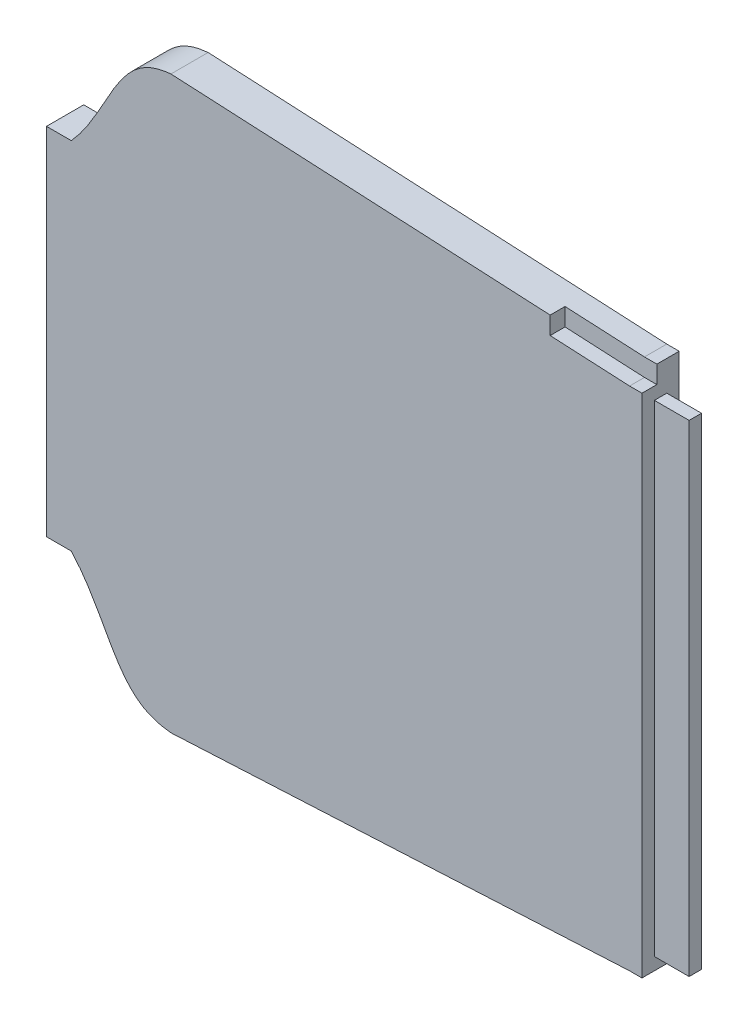
ISO-10303-21;
HEADER;
FILE_DESCRIPTION(('STEP AP214'),'2;1');
FILE_NAME('part.step','',(''),(''),'','','');
FILE_SCHEMA(('AUTOMOTIVE_DESIGN { 1 0 10303 214 1 1 1 1 }'));
ENDSEC;
DATA;
#1=APPLICATION_CONTEXT('core data for automotive mechanical design processes');
#2=APPLICATION_PROTOCOL_DEFINITION('international standard','automotive_design',2000,#1);
#3=PRODUCT_CONTEXT('',#1,'mechanical');
#4=PRODUCT('Part','Part','',(#3));
#5=PRODUCT_RELATED_PRODUCT_CATEGORY('part','',(#4));
#6=PRODUCT_DEFINITION_FORMATION('','',#4);
#7=PRODUCT_DEFINITION_CONTEXT('part definition',#1,'design');
#8=PRODUCT_DEFINITION('design','',#6,#7);
#9=PRODUCT_DEFINITION_SHAPE('','',#8);
#10=(LENGTH_UNIT() NAMED_UNIT(*) SI_UNIT(.MILLI.,.METRE.));
#11=(NAMED_UNIT(*) PLANE_ANGLE_UNIT() SI_UNIT($,.RADIAN.));
#12=(NAMED_UNIT(*) SI_UNIT($,.STERADIAN.) SOLID_ANGLE_UNIT());
#13=UNCERTAINTY_MEASURE_WITH_UNIT(LENGTH_MEASURE(1.E-05),#10,'distance_accuracy_value','');
#14=(GEOMETRIC_REPRESENTATION_CONTEXT(3) GLOBAL_UNCERTAINTY_ASSIGNED_CONTEXT((#13)) GLOBAL_UNIT_ASSIGNED_CONTEXT((#10,
#11,#12)) REPRESENTATION_CONTEXT('',''));
#15=CARTESIAN_POINT('',(0.,0.,0.));
#16=DIRECTION('',(0.,0.,1.));
#17=DIRECTION('',(1.,0.,0.));
#18=AXIS2_PLACEMENT_3D('',#15,#16,#17);
#19=CARTESIAN_POINT('',(-75.9633453556021,51.4759528273383,7.5));
#20=CARTESIAN_POINT('',(-76.9697609445029,51.3853111688269,7.5));
#21=CARTESIAN_POINT('',(-77.9566640125475,51.2137423355585,7.5));
#22=CARTESIAN_POINT('',(-79.3958667890357,50.7857140096499,7.5));
#23=CARTESIAN_POINT('',(-79.8697086301998,50.6138711938557,7.5));
#24=CARTESIAN_POINT('',(-80.7968371847401,50.2045771988286,7.5));
#25=CARTESIAN_POINT('',(-81.2405903652447,49.971323111468,7.5));
#26=CARTESIAN_POINT('',(-82.0897874142373,49.4494965490873,7.5));
#27=CARTESIAN_POINT('',(-82.4952469763131,49.160946735502,7.5));
#28=CARTESIAN_POINT('',(-83.2714650489406,48.5337390244384,7.5));
#29=CARTESIAN_POINT('',(-83.6430074345988,48.1943757140935,7.5));
#30=CARTESIAN_POINT('',(-84.7084440423344,47.1167950418134,7.5));
#31=CARTESIAN_POINT('',(-85.3332150008267,46.3433741392448,7.5));
#32=CARTESIAN_POINT('',(-86.4912968836569,44.7376760965746,7.5));
#33=CARTESIAN_POINT('',(-87.0238276066962,43.9048968823881,7.5));
#34=CARTESIAN_POINT('',(-88.0448723627031,42.2110128931271,7.5));
#35=CARTESIAN_POINT('',(-88.5330340538759,41.349681379537,7.5));
#36=CARTESIAN_POINT('',(-89.9829007271193,38.7562796255846,7.5));
#37=CARTESIAN_POINT('',(-90.9324072603648,37.0136286536666,7.5));
#38=CARTESIAN_POINT('',(-92.999467157365,33.6503839465377,7.5));
#39=CARTESIAN_POINT('',(-94.1145861067505,32.0312326414741,7.5));
#40=CARTESIAN_POINT('',(-95.6033721198785,30.2877052809041,7.5));
#41=CARTESIAN_POINT('',(-95.8197445647223,30.0428919157174,7.5));
#42=CARTESIAN_POINT('',(-96.0408999342454,29.8017407392617,7.5));
#43=B_SPLINE_CURVE_WITH_KNOTS('',3,(#19,#20,#21,#22,#23,#24,#25,#26,#27,#28,#29,#30,#31,#32,#33,
#34,#35,#36,#37,#38,#39,#40,#41,#42),.UNSPECIFIED.,.F.,.F.,(4,2,2,2,2,2,2,2,2,2,2,4),(0.,
0.0624999999999994,0.0937499999999991,0.124999999999999,0.156249999999999,0.187499999999998,
0.249999999999998,0.312499999999998,0.374999999999998,0.499999999999997,0.624999999999997,
0.645748557674842),.UNSPECIFIED.);
#44=DIRECTION('',(0.,0.,-1.));
#45=VECTOR('',#44,1.);
#46=SURFACE_OF_LINEAR_EXTRUSION('',#43,#45);
#47=CARTESIAN_POINT('',(-75.9633453556021,51.4759528273383,0.));
#48=CARTESIAN_POINT('',(-76.9697609445029,51.3853111688269,0.));
#49=CARTESIAN_POINT('',(-77.9566640125475,51.2137423355585,0.));
#50=CARTESIAN_POINT('',(-79.3958667890357,50.7857140096499,0.));
#51=CARTESIAN_POINT('',(-79.8697086301998,50.6138711938557,0.));
#52=CARTESIAN_POINT('',(-80.7968371847401,50.2045771988286,0.));
#53=CARTESIAN_POINT('',(-81.2405903652447,49.971323111468,0.));
#54=CARTESIAN_POINT('',(-82.0897874142373,49.4494965490873,0.));
#55=CARTESIAN_POINT('',(-82.4952469763131,49.160946735502,0.));
#56=CARTESIAN_POINT('',(-83.2714650489406,48.5337390244384,0.));
#57=CARTESIAN_POINT('',(-83.6430074345988,48.1943757140935,0.));
#58=CARTESIAN_POINT('',(-84.7084440423344,47.1167950418134,0.));
#59=CARTESIAN_POINT('',(-85.3332150008267,46.3433741392448,0.));
#60=CARTESIAN_POINT('',(-86.4912968836569,44.7376760965746,0.));
#61=CARTESIAN_POINT('',(-87.0238276066962,43.9048968823881,0.));
#62=CARTESIAN_POINT('',(-88.0448723627031,42.2110128931271,0.));
#63=CARTESIAN_POINT('',(-88.5330340538759,41.349681379537,0.));
#64=CARTESIAN_POINT('',(-89.9829007271193,38.7562796255846,0.));
#65=CARTESIAN_POINT('',(-90.9324072603648,37.0136286536666,0.));
#66=CARTESIAN_POINT('',(-92.999467157365,33.6503839465377,0.));
#67=CARTESIAN_POINT('',(-94.1145861067505,32.0312326414741,0.));
#68=CARTESIAN_POINT('',(-95.6033721198785,30.2877052809041,0.));
#69=CARTESIAN_POINT('',(-95.8197445647223,30.0428919157174,0.));
#70=CARTESIAN_POINT('',(-96.0408999342454,29.8017407392617,0.));
#71=B_SPLINE_CURVE_WITH_KNOTS('',3,(#47,#48,#49,#50,#51,#52,#53,#54,#55,#56,#57,#58,#59,#60,#61,
#62,#63,#64,#65,#66,#67,#68,#69,#70),.UNSPECIFIED.,.F.,.F.,(4,2,2,2,2,2,2,2,2,2,2,4),(0.,
0.0624999999999994,0.0937499999999991,0.124999999999999,0.156249999999999,0.187499999999998,
0.249999999999998,0.312499999999998,0.374999999999998,0.499999999999997,0.624999999999997,
0.645748557674842),.UNSPECIFIED.);
#72=CARTESIAN_POINT('',(-75.9633453556021,51.4759528273383,0.));
#73=VERTEX_POINT('',#72);
#74=CARTESIAN_POINT('',(-96.0408999342454,29.8017407392617,0.));
#75=VERTEX_POINT('',#74);
#76=EDGE_CURVE('E231',#73,#75,#71,.T.);
#77=ORIENTED_EDGE('',*,*,#76,.T.);
#78=DIRECTION('',(0.,0.,-1.));
#79=VECTOR('',#78,1.);
#80=CARTESIAN_POINT('',(-96.0408999342454,29.8017407392617,7.5));
#81=LINE('',#80,#79);
#82=CARTESIAN_POINT('',(-96.0408999342454,29.8017407392617,7.5));
#83=VERTEX_POINT('',#82);
#84=EDGE_CURVE('E391',#83,#75,#81,.T.);
#85=ORIENTED_EDGE('',*,*,#84,.F.);
#86=CARTESIAN_POINT('',(-96.0408999342454,29.8017407392617,7.5));
#87=CARTESIAN_POINT('',(-95.8197445647223,30.0428919157174,7.5));
#88=CARTESIAN_POINT('',(-95.6033721198785,30.2877052809041,7.5));
#89=CARTESIAN_POINT('',(-94.1145861067505,32.0312326414741,7.5));
#90=CARTESIAN_POINT('',(-92.999467157365,33.6503839465377,7.5));
#91=CARTESIAN_POINT('',(-90.9324072603648,37.0136286536666,7.5));
#92=CARTESIAN_POINT('',(-89.9829007271193,38.7562796255846,7.5));
#93=CARTESIAN_POINT('',(-88.5330340538759,41.349681379537,7.5));
#94=CARTESIAN_POINT('',(-88.0448723627031,42.2110128931271,7.5));
#95=CARTESIAN_POINT('',(-87.0238276066962,43.9048968823881,7.5));
#96=CARTESIAN_POINT('',(-86.4912968836569,44.7376760965746,7.5));
#97=CARTESIAN_POINT('',(-85.3332150008267,46.3433741392448,7.5));
#98=CARTESIAN_POINT('',(-84.7084440423344,47.1167950418134,7.5));
#99=CARTESIAN_POINT('',(-83.6430074345988,48.1943757140935,7.5));
#100=CARTESIAN_POINT('',(-83.2714650489406,48.5337390244384,7.5));
#101=CARTESIAN_POINT('',(-82.4952469763131,49.160946735502,7.5));
#102=CARTESIAN_POINT('',(-82.0897874142373,49.4494965490873,7.5));
#103=CARTESIAN_POINT('',(-81.2405903652447,49.971323111468,7.5));
#104=CARTESIAN_POINT('',(-80.7968371847401,50.2045771988286,7.5));
#105=CARTESIAN_POINT('',(-79.8697086301998,50.6138711938557,7.5));
#106=CARTESIAN_POINT('',(-79.3958667890357,50.7857140096499,7.5));
#107=CARTESIAN_POINT('',(-77.9566640125475,51.2137423355585,7.5));
#108=CARTESIAN_POINT('',(-76.9697609445029,51.3853111688269,7.5));
#109=CARTESIAN_POINT('',(-75.9633453556021,51.4759528273383,7.5));
#110=B_SPLINE_CURVE_WITH_KNOTS('',3,(#86,#87,#88,#89,#90,#91,#92,#93,#94,#95,#96,#97,#98,#99,
#100,#101,#102,#103,#104,#105,#106,#107,#108,#109),.UNSPECIFIED.,.F.,.F.,(4,2,2,2,2,2,2,2,2,2,2,
4),(0.,0.0207485576748445,0.145748557674845,0.270748557674844,0.333248557674844,
0.395748557674844,0.458248557674844,0.489498557674843,0.520748557674843,0.551998557674843,
0.583248557674843,0.645748557674842),.UNSPECIFIED.);
#111=CARTESIAN_POINT('',(-75.9633453556021,51.4759528273383,7.5));
#112=VERTEX_POINT('',#111);
#113=EDGE_CURVE('E388',#112,#83,#110,.F.);
#114=ORIENTED_EDGE('',*,*,#113,.F.);
#115=DIRECTION('',(0.,0.,-1.));
#116=VECTOR('',#115,1.);
#117=CARTESIAN_POINT('',(-75.9633453556021,51.4759528273383,7.5));
#118=LINE('',#117,#116);
#119=EDGE_CURVE('E327',#112,#73,#118,.T.);
#120=ORIENTED_EDGE('',*,*,#119,.T.);
#121=EDGE_LOOP('',(#77,#85,#114,#120));
#122=FACE_BOUND('',#121,.T.);
#123=ADVANCED_FACE('F36',(#122),#46,.F.);
#124=CARTESIAN_POINT('',(-101.040899934245,29.8017407392617,7.5));
#125=DIRECTION('',(0.,-1.,0.));
#126=DIRECTION('',(0.,0.,-1.));
#127=AXIS2_PLACEMENT_3D('',#124,#125,#126);
#128=PLANE('',#127);
#129=DIRECTION('',(-1.,0.,0.));
#130=VECTOR('',#129,1.);
#131=CARTESIAN_POINT('',(-101.040899934245,29.8017407392617,0.));
#132=LINE('',#131,#130);
#133=CARTESIAN_POINT('',(-101.040899934245,29.8017407392617,0.));
#134=VERTEX_POINT('',#133);
#135=EDGE_CURVE('E315',#75,#134,#132,.T.);
#136=ORIENTED_EDGE('',*,*,#135,.T.);
#137=DIRECTION('',(0.,0.,-1.));
#138=VECTOR('',#137,1.);
#139=CARTESIAN_POINT('',(-101.040899934245,29.8017407392617,7.5));
#140=LINE('',#139,#138);
#141=CARTESIAN_POINT('',(-101.040899934245,29.8017407392617,7.5));
#142=VERTEX_POINT('',#141);
#143=EDGE_CURVE('E334',#142,#134,#140,.T.);
#144=ORIENTED_EDGE('',*,*,#143,.F.);
#145=DIRECTION('',(-1.,0.,0.));
#146=VECTOR('',#145,1.);
#147=CARTESIAN_POINT('',(-101.040899934245,29.8017407392617,7.5));
#148=LINE('',#147,#146);
#149=EDGE_CURVE('E243',#83,#142,#148,.T.);
#150=ORIENTED_EDGE('',*,*,#149,.F.);
#151=ORIENTED_EDGE('',*,*,#84,.T.);
#152=EDGE_LOOP('',(#136,#144,#150,#151));
#153=FACE_BOUND('',#152,.T.);
#154=ADVANCED_FACE('F411',(#153),#128,.F.);
#155=CARTESIAN_POINT('',(-101.040899934245,-41.8292599626899,7.5));
#156=DIRECTION('',(1.,0.,0.));
#157=DIRECTION('',(0.,0.,-1.));
#158=AXIS2_PLACEMENT_3D('',#155,#156,#157);
#159=PLANE('',#158);
#160=DIRECTION('',(0.,-1.,0.));
#161=VECTOR('',#160,1.);
#162=CARTESIAN_POINT('',(-101.040899934245,-41.8292599626899,0.));
#163=LINE('',#162,#161);
#164=CARTESIAN_POINT('',(-101.040899934245,-41.8292599626899,0.));
#165=VERTEX_POINT('',#164);
#166=EDGE_CURVE('E248',#134,#165,#163,.T.);
#167=ORIENTED_EDGE('',*,*,#166,.T.);
#168=DIRECTION('',(0.,0.,-1.));
#169=VECTOR('',#168,1.);
#170=CARTESIAN_POINT('',(-101.040899934245,-41.8292599626899,7.5));
#171=LINE('',#170,#169);
#172=CARTESIAN_POINT('',(-101.040899934245,-41.8292599626899,7.5));
#173=VERTEX_POINT('',#172);
#174=EDGE_CURVE('E369',#173,#165,#171,.T.);
#175=ORIENTED_EDGE('',*,*,#174,.F.);
#176=DIRECTION('',(0.,-1.,0.));
#177=VECTOR('',#176,1.);
#178=CARTESIAN_POINT('',(-101.040899934245,-41.8292599626899,7.5));
#179=LINE('',#178,#177);
#180=EDGE_CURVE('E237',#142,#173,#179,.T.);
#181=ORIENTED_EDGE('',*,*,#180,.F.);
#182=ORIENTED_EDGE('',*,*,#143,.T.);
#183=EDGE_LOOP('',(#167,#175,#181,#182));
#184=FACE_BOUND('',#183,.T.);
#185=ADVANCED_FACE('F615',(#184),#159,.F.);
#186=CARTESIAN_POINT('',(-96.0408999342454,-41.8292599626899,7.5));
#187=DIRECTION('',(0.,1.,0.));
#188=DIRECTION('',(0.,0.,1.));
#189=AXIS2_PLACEMENT_3D('',#186,#187,#188);
#190=PLANE('',#189);
#191=DIRECTION('',(1.,0.,0.));
#192=VECTOR('',#191,1.);
#193=CARTESIAN_POINT('',(-96.0408999342454,-41.8292599626899,0.));
#194=LINE('',#193,#192);
#195=CARTESIAN_POINT('',(-96.0408999342454,-41.8292599626899,0.));
#196=VERTEX_POINT('',#195);
#197=EDGE_CURVE('E291',#165,#196,#194,.T.);
#198=ORIENTED_EDGE('',*,*,#197,.T.);
#199=DIRECTION('',(0.,0.,-1.));
#200=VECTOR('',#199,1.);
#201=CARTESIAN_POINT('',(-96.0408999342454,-41.8292599626899,7.5));
#202=LINE('',#201,#200);
#203=CARTESIAN_POINT('',(-96.0408999342454,-41.8292599626899,7.5));
#204=VERTEX_POINT('',#203);
#205=EDGE_CURVE('E360',#204,#196,#202,.T.);
#206=ORIENTED_EDGE('',*,*,#205,.F.);
#207=DIRECTION('',(1.,0.,0.));
#208=VECTOR('',#207,1.);
#209=CARTESIAN_POINT('',(-96.0408999342454,-41.8292599626899,7.5));
#210=LINE('',#209,#208);
#211=EDGE_CURVE('E242',#173,#204,#210,.T.);
#212=ORIENTED_EDGE('',*,*,#211,.F.);
#213=ORIENTED_EDGE('',*,*,#174,.T.);
#214=EDGE_LOOP('',(#198,#206,#212,#213));
#215=FACE_BOUND('',#214,.T.);
#216=ADVANCED_FACE('F260',(#215),#190,.F.);
#217=CARTESIAN_POINT('',(-96.0408999342454,-41.8292599626899,7.5));
#218=CARTESIAN_POINT('',(-95.7988992682846,-42.0931600962344,7.5));
#219=CARTESIAN_POINT('',(-95.561972130062,-42.3621361828799,7.5));
#220=CARTESIAN_POINT('',(-94.0395496597358,-44.1567580273599,7.5));
#221=CARTESIAN_POINT('',(-92.923608678234,-45.7924124369332,7.5));
#222=CARTESIAN_POINT('',(-90.8584877162527,-49.1709486953091,7.5));
#223=CARTESIAN_POINT('',(-89.9110655120972,-50.9149607955065,7.5));
#224=CARTESIAN_POINT('',(-88.4577666320856,-53.510296459571,7.5));
#225=CARTESIAN_POINT('',(-87.9675202616666,-54.3719999042443,7.5));
#226=CARTESIAN_POINT('',(-86.9408927812385,-56.0639292800719,7.5));
#227=CARTESIAN_POINT('',(-86.4049123225657,-56.8942548138955,7.5));
#228=CARTESIAN_POINT('',(-85.5306714386245,-58.0912594126719,7.5));
#229=CARTESIAN_POINT('',(-85.2274148024828,-58.4820897306125,7.5));
#230=CARTESIAN_POINT('',(-84.5888180979117,-59.2416140461347,7.5));
#231=CARTESIAN_POINT('',(-84.2541847043079,-59.609132258988,7.5));
#232=CARTESIAN_POINT('',(-83.2049299164517,-60.6516003972093,7.5));
#233=CARTESIAN_POINT('',(-82.4405695411778,-61.2705768908685,7.5));
#234=CARTESIAN_POINT('',(-81.160629248783,-62.0427184442392,7.5));
#235=CARTESIAN_POINT('',(-80.7192557418982,-62.2694331130613,7.5));
#236=CARTESIAN_POINT('',(-79.8173141056628,-62.6608889281113,7.5));
#237=CARTESIAN_POINT('',(-79.3554021000776,-62.8265490472613,7.5));
#238=CARTESIAN_POINT('',(-77.9404670922337,-63.2432868270751,7.5));
#239=CARTESIAN_POINT('',(-76.9542083277771,-63.4142013981837,7.5));
#240=CARTESIAN_POINT('',(-75.9633453556009,-63.5034423282191,7.5));
#241=B_SPLINE_CURVE_WITH_KNOTS('',3,(#217,#218,#219,#220,#221,#222,#223,#224,#225,#226,#227,
#228,#229,#230,#231,#232,#233,#234,#235,#236,#237,#238,#239,#240),.UNSPECIFIED.,.F.,.F.,(4,2,2,
2,2,2,2,2,2,2,2,4),(0.352672192174141,0.375000000000001,0.500000000000001,0.625000000000001,
0.687500000000001,0.750000000000001,0.781250000000001,0.812500000000001,0.875000000000001,
0.90625,0.9375,1.),.UNSPECIFIED.);
#242=DIRECTION('',(0.,0.,-1.));
#243=VECTOR('',#242,1.);
#244=SURFACE_OF_LINEAR_EXTRUSION('',#241,#243);
#245=CARTESIAN_POINT('',(-96.0408999342454,-41.8292599626899,0.));
#246=CARTESIAN_POINT('',(-95.7988992682846,-42.0931600962344,0.));
#247=CARTESIAN_POINT('',(-95.561972130062,-42.3621361828799,0.));
#248=CARTESIAN_POINT('',(-94.0395496597358,-44.1567580273599,0.));
#249=CARTESIAN_POINT('',(-92.923608678234,-45.7924124369332,0.));
#250=CARTESIAN_POINT('',(-90.8584877162527,-49.1709486953091,0.));
#251=CARTESIAN_POINT('',(-89.9110655120972,-50.9149607955065,0.));
#252=CARTESIAN_POINT('',(-88.4577666320856,-53.510296459571,0.));
#253=CARTESIAN_POINT('',(-87.9675202616666,-54.3719999042443,0.));
#254=CARTESIAN_POINT('',(-86.9408927812385,-56.0639292800719,0.));
#255=CARTESIAN_POINT('',(-86.4049123225657,-56.8942548138955,0.));
#256=CARTESIAN_POINT('',(-85.5306714386245,-58.0912594126719,0.));
#257=CARTESIAN_POINT('',(-85.2274148024828,-58.4820897306125,0.));
#258=CARTESIAN_POINT('',(-84.5888180979117,-59.2416140461347,0.));
#259=CARTESIAN_POINT('',(-84.2541847043079,-59.609132258988,0.));
#260=CARTESIAN_POINT('',(-83.2049299164517,-60.6516003972093,0.));
#261=CARTESIAN_POINT('',(-82.4405695411778,-61.2705768908685,0.));
#262=CARTESIAN_POINT('',(-81.160629248783,-62.0427184442392,0.));
#263=CARTESIAN_POINT('',(-80.7192557418982,-62.2694331130613,0.));
#264=CARTESIAN_POINT('',(-79.8173141056628,-62.6608889281113,0.));
#265=CARTESIAN_POINT('',(-79.3554021000776,-62.8265490472613,0.));
#266=CARTESIAN_POINT('',(-77.9404670922337,-63.2432868270751,0.));
#267=CARTESIAN_POINT('',(-76.9542083277771,-63.4142013981837,0.));
#268=CARTESIAN_POINT('',(-75.9633453556009,-63.5034423282191,0.));
#269=B_SPLINE_CURVE_WITH_KNOTS('',3,(#245,#246,#247,#248,#249,#250,#251,#252,#253,#254,#255,
#256,#257,#258,#259,#260,#261,#262,#263,#264,#265,#266,#267,#268),.UNSPECIFIED.,.F.,.F.,(4,2,2,
2,2,2,2,2,2,2,2,4),(0.352672192174141,0.375000000000001,0.500000000000001,0.625000000000001,
0.687500000000001,0.750000000000001,0.781250000000001,0.812500000000001,0.875000000000001,
0.90625,0.9375,1.),.UNSPECIFIED.);
#270=CARTESIAN_POINT('',(-75.9633453556009,-63.5034423282191,0.));
#271=VERTEX_POINT('',#270);
#272=EDGE_CURVE('E286',#196,#271,#269,.T.);
#273=ORIENTED_EDGE('',*,*,#272,.T.);
#274=DIRECTION('',(0.,0.,-1.));
#275=VECTOR('',#274,1.);
#276=CARTESIAN_POINT('',(-75.9633453556009,-63.5034423282191,7.5));
#277=LINE('',#276,#275);
#278=CARTESIAN_POINT('',(-75.9633453556009,-63.5034423282191,7.5));
#279=VERTEX_POINT('',#278);
#280=EDGE_CURVE('E362',#279,#271,#277,.T.);
#281=ORIENTED_EDGE('',*,*,#280,.F.);
#282=CARTESIAN_POINT('',(-75.9633453556009,-63.5034423282191,7.5));
#283=CARTESIAN_POINT('',(-76.9542083277771,-63.4142013981837,7.5));
#284=CARTESIAN_POINT('',(-77.9404670922337,-63.2432868270751,7.5));
#285=CARTESIAN_POINT('',(-79.3554021000776,-62.8265490472613,7.5));
#286=CARTESIAN_POINT('',(-79.8173141056628,-62.6608889281113,7.5));
#287=CARTESIAN_POINT('',(-80.7192557418982,-62.2694331130613,7.5));
#288=CARTESIAN_POINT('',(-81.160629248783,-62.0427184442392,7.5));
#289=CARTESIAN_POINT('',(-82.4405695411778,-61.2705768908685,7.5));
#290=CARTESIAN_POINT('',(-83.2049299164517,-60.6516003972093,7.5));
#291=CARTESIAN_POINT('',(-84.2541847043079,-59.609132258988,7.5));
#292=CARTESIAN_POINT('',(-84.5888180979117,-59.2416140461347,7.5));
#293=CARTESIAN_POINT('',(-85.2274148024828,-58.4820897306125,7.5));
#294=CARTESIAN_POINT('',(-85.5306714386245,-58.0912594126719,7.5));
#295=CARTESIAN_POINT('',(-86.4049123225657,-56.8942548138955,7.5));
#296=CARTESIAN_POINT('',(-86.9408927812385,-56.0639292800719,7.5));
#297=CARTESIAN_POINT('',(-87.9675202616666,-54.3719999042443,7.5));
#298=CARTESIAN_POINT('',(-88.4577666320856,-53.510296459571,7.5));
#299=CARTESIAN_POINT('',(-89.9110655120972,-50.9149607955065,7.5));
#300=CARTESIAN_POINT('',(-90.8584877162527,-49.1709486953091,7.5));
#301=CARTESIAN_POINT('',(-92.923608678234,-45.7924124369332,7.5));
#302=CARTESIAN_POINT('',(-94.0395496597358,-44.1567580273599,7.5));
#303=CARTESIAN_POINT('',(-95.561972130062,-42.3621361828799,7.5));
#304=CARTESIAN_POINT('',(-95.7988992682846,-42.0931600962344,7.5));
#305=CARTESIAN_POINT('',(-96.0408999342454,-41.8292599626899,7.5));
#306=B_SPLINE_CURVE_WITH_KNOTS('',3,(#282,#283,#284,#285,#286,#287,#288,#289,#290,#291,#292,
#293,#294,#295,#296,#297,#298,#299,#300,#301,#302,#303,#304,#305),.UNSPECIFIED.,.F.,.F.,(4,2,2,
2,2,2,2,2,2,2,2,4),(0.352672192174141,0.415172192174141,0.446422192174141,0.477672192174141,
0.54017219217414,0.57142219217414,0.60267219217414,0.66517219217414,0.72767219217414,
0.85267219217414,0.97767219217414,1.),.UNSPECIFIED.);
#307=EDGE_CURVE('E339',#204,#279,#306,.F.);
#308=ORIENTED_EDGE('',*,*,#307,.F.);
#309=ORIENTED_EDGE('',*,*,#205,.T.);
#310=EDGE_LOOP('',(#273,#281,#308,#309));
#311=FACE_BOUND('',#310,.T.);
#312=ADVANCED_FACE('F254',(#311),#244,.F.);
#313=CARTESIAN_POINT('',(-75.9633453556009,-63.5034423282191,7.5));
#314=DIRECTION('',(-0.0504790708541748,0.998725119042121,0.));
#315=DIRECTION('',(-0.998725119042121,-0.0504790708541748,0.));
#316=AXIS2_PLACEMENT_3D('',#313,#314,#315);
#317=PLANE('',#316);
#318=DIRECTION('',(0.998725119042121,0.0504790708541748,0.));
#319=VECTOR('',#318,1.);
#320=CARTESIAN_POINT('',(-75.9633453556009,-63.5034423282191,0.));
#321=LINE('',#320,#319);
#322=CARTESIAN_POINT('',(16.4591000657546,-58.8320877362616,0.));
#323=VERTEX_POINT('',#322);
#324=EDGE_CURVE('E342',#271,#323,#321,.T.);
#325=ORIENTED_EDGE('',*,*,#324,.T.);
#326=DIRECTION('',(0.,0.,1.));
#327=VECTOR('',#326,1.);
#328=CARTESIAN_POINT('',(16.4591000657546,-58.8320877362616,7.5));
#329=LINE('',#328,#327);
#330=CARTESIAN_POINT('',(16.4591000657546,-58.8320877362616,7.5));
#331=VERTEX_POINT('',#330);
#332=EDGE_CURVE('E11',#323,#331,#329,.T.);
#333=ORIENTED_EDGE('',*,*,#332,.T.);
#334=DIRECTION('',(0.998725119042121,0.0504790708541748,0.));
#335=VECTOR('',#334,1.);
#336=CARTESIAN_POINT('',(-75.9633453556009,-63.5034423282191,7.5));
#337=LINE('',#336,#335);
#338=EDGE_CURVE('E328',#279,#331,#337,.T.);
#339=ORIENTED_EDGE('',*,*,#338,.F.);
#340=ORIENTED_EDGE('',*,*,#280,.T.);
#341=EDGE_LOOP('',(#325,#333,#339,#340));
#342=FACE_BOUND('',#341,.T.);
#343=ADVANCED_FACE('F259',(#342),#317,.F.);
#344=CARTESIAN_POINT('',(113.496599029254,41.8999826486839,7.5));
#345=DIRECTION('',(-0.0504790708541185,-0.998725119042124,0.));
#346=DIRECTION('',(0.998725119042124,-0.0504790708541185,0.));
#347=AXIS2_PLACEMENT_3D('',#344,#345,#346);
#348=PLANE('',#347);
#349=DIRECTION('',(0.998725119042124,-0.0504790708541185,0.));
#350=VECTOR('',#349,1.);
#351=CARTESIAN_POINT('',(0.459100065754559,47.6132943603423,4.5));
#352=LINE('',#351,#350);
#353=CARTESIAN_POINT('',(0.459100065754559,47.6132943603423,4.5));
#354=VERTEX_POINT('',#353);
#355=CARTESIAN_POINT('',(16.4591000657546,46.804598235386,4.5));
#356=VERTEX_POINT('',#355);
#357=EDGE_CURVE('E222',#354,#356,#352,.T.);
#358=ORIENTED_EDGE('',*,*,#357,.T.);
#359=DIRECTION('',(0.,0.,-1.));
#360=VECTOR('',#359,1.);
#361=CARTESIAN_POINT('',(16.4591000657546,46.804598235386,7.5));
#362=LINE('',#361,#360);
#363=CARTESIAN_POINT('',(16.4591000657546,46.804598235386,0.));
#364=VERTEX_POINT('',#363);
#365=EDGE_CURVE('E45',#356,#364,#362,.T.);
#366=ORIENTED_EDGE('',*,*,#365,.T.);
#367=DIRECTION('',(-0.998725119042124,0.0504790708541185,0.));
#368=VECTOR('',#367,1.);
#369=CARTESIAN_POINT('',(113.496599029254,41.8999826486839,0.));
#370=LINE('',#369,#368);
#371=EDGE_CURVE('E329',#364,#73,#370,.T.);
#372=ORIENTED_EDGE('',*,*,#371,.T.);
#373=ORIENTED_EDGE('',*,*,#119,.F.);
#374=DIRECTION('',(-0.998725119042124,0.0504790708541185,0.));
#375=VECTOR('',#374,1.);
#376=CARTESIAN_POINT('',(113.496599029254,41.8999826486839,7.5));
#377=LINE('',#376,#375);
#378=CARTESIAN_POINT('',(0.459100065754559,47.6132943603423,7.5));
#379=VERTEX_POINT('',#378);
#380=EDGE_CURVE('E324',#379,#112,#377,.T.);
#381=ORIENTED_EDGE('',*,*,#380,.F.);
#382=DIRECTION('',(0.,0.,1.));
#383=VECTOR('',#382,1.);
#384=CARTESIAN_POINT('',(0.459100065754559,47.6132943603423,4.5));
#385=LINE('',#384,#383);
#386=EDGE_CURVE('E229',#354,#379,#385,.T.);
#387=ORIENTED_EDGE('',*,*,#386,.F.);
#388=EDGE_LOOP('',(#358,#366,#372,#373,#381,#387));
#389=FACE_BOUND('',#388,.T.);
#390=ADVANCED_FACE('F306',(#389),#348,.F.);
#391=CARTESIAN_POINT('',(-87.7868041786044,42.6350691720137,7.5));
#392=DIRECTION('',(0.,0.,-1.));
#393=DIRECTION('',(-1.,0.,0.));
#394=AXIS2_PLACEMENT_3D('',#391,#392,#393);
#395=PLANE('',#394);
#396=ORIENTED_EDGE('',*,*,#338,.T.);
#397=DIRECTION('',(-1.,0.,0.));
#398=VECTOR('',#397,1.);
#399=CARTESIAN_POINT('',(18.9591000657546,-58.8320877362616,7.5));
#400=LINE('',#399,#398);
#401=CARTESIAN_POINT('',(18.9591000657546,-58.8320877362616,7.5));
#402=VERTEX_POINT('',#401);
#403=EDGE_CURVE('E200',#402,#331,#400,.T.);
#404=ORIENTED_EDGE('',*,*,#403,.F.);
#405=DIRECTION('',(0.,-1.,0.));
#406=VECTOR('',#405,1.);
#407=CARTESIAN_POINT('',(18.9591000657546,43.2293871203873,7.5));
#408=LINE('',#407,#406);
#409=CARTESIAN_POINT('',(18.9591000657546,43.2293871203873,7.5));
#410=VERTEX_POINT('',#409);
#411=EDGE_CURVE('E198',#410,#402,#408,.T.);
#412=ORIENTED_EDGE('',*,*,#411,.F.);
#413=DIRECTION('',(-1.,0.,0.));
#414=VECTOR('',#413,1.);
#415=CARTESIAN_POINT('',(18.9591000657546,43.2293871203873,7.5));
#416=LINE('',#415,#414);
#417=CARTESIAN_POINT('',(16.4591000657546,43.2293871203873,7.5));
#418=VERTEX_POINT('',#417);
#419=EDGE_CURVE('E202',#410,#418,#416,.T.);
#420=ORIENTED_EDGE('',*,*,#419,.T.);
#421=DIRECTION('',(0.998725119042124,-0.0504790708541182,0.));
#422=VECTOR('',#421,1.);
#423=CARTESIAN_POINT('',(0.459100065754559,44.0380832453436,7.5));
#424=LINE('',#423,#422);
#425=CARTESIAN_POINT('',(0.459100065754559,44.0380832453436,7.5));
#426=VERTEX_POINT('',#425);
#427=EDGE_CURVE('E219',#426,#418,#424,.T.);
#428=ORIENTED_EDGE('',*,*,#427,.F.);
#429=DIRECTION('',(0.,-1.,0.));
#430=VECTOR('',#429,1.);
#431=CARTESIAN_POINT('',(0.459100065754559,47.6132943603423,7.5));
#432=LINE('',#431,#430);
#433=EDGE_CURVE('E214',#379,#426,#432,.T.);
#434=ORIENTED_EDGE('',*,*,#433,.F.);
#435=ORIENTED_EDGE('',*,*,#380,.T.);
#436=ORIENTED_EDGE('',*,*,#113,.T.);
#437=ORIENTED_EDGE('',*,*,#149,.T.);
#438=ORIENTED_EDGE('',*,*,#180,.T.);
#439=ORIENTED_EDGE('',*,*,#211,.T.);
#440=ORIENTED_EDGE('',*,*,#307,.T.);
#441=EDGE_LOOP('',(#396,#404,#412,#420,#428,#434,#435,#436,#437,#438,#439,#440));
#442=FACE_BOUND('',#441,.T.);
#443=ADVANCED_FACE('F303',(#442),#395,.F.);
#444=CARTESIAN_POINT('',(-87.7868041786044,42.6350691720137,0.));
#445=DIRECTION('',(0.,0.,-1.));
#446=DIRECTION('',(-1.,0.,0.));
#447=AXIS2_PLACEMENT_3D('',#444,#445,#446);
#448=PLANE('',#447);
#449=ORIENTED_EDGE('',*,*,#371,.F.);
#450=DIRECTION('',(-1.,0.,0.));
#451=VECTOR('',#450,1.);
#452=CARTESIAN_POINT('',(18.9591000657546,46.804598235386,0.));
#453=LINE('',#452,#451);
#454=CARTESIAN_POINT('',(18.9591000657546,46.804598235386,0.));
#455=VERTEX_POINT('',#454);
#456=EDGE_CURVE('E210',#455,#364,#453,.T.);
#457=ORIENTED_EDGE('',*,*,#456,.F.);
#458=DIRECTION('',(0.,1.,0.));
#459=VECTOR('',#458,1.);
#460=CARTESIAN_POINT('',(18.9591000657546,-58.8320877362616,0.));
#461=LINE('',#460,#459);
#462=CARTESIAN_POINT('',(18.9591000657546,-58.8320877362616,0.));
#463=VERTEX_POINT('',#462);
#464=EDGE_CURVE('E185',#463,#455,#461,.T.);
#465=ORIENTED_EDGE('',*,*,#464,.F.);
#466=DIRECTION('',(-1.,0.,0.));
#467=VECTOR('',#466,1.);
#468=CARTESIAN_POINT('',(18.9591000657546,-58.8320877362616,0.));
#469=LINE('',#468,#467);
#470=EDGE_CURVE('E212',#463,#323,#469,.T.);
#471=ORIENTED_EDGE('',*,*,#470,.T.);
#472=ORIENTED_EDGE('',*,*,#324,.F.);
#473=ORIENTED_EDGE('',*,*,#272,.F.);
#474=ORIENTED_EDGE('',*,*,#197,.F.);
#475=ORIENTED_EDGE('',*,*,#166,.F.);
#476=ORIENTED_EDGE('',*,*,#135,.F.);
#477=ORIENTED_EDGE('',*,*,#76,.F.);
#478=EDGE_LOOP('',(#449,#457,#465,#471,#472,#473,#474,#475,#476,#477));
#479=FACE_BOUND('',#478,.T.);
#480=ADVANCED_FACE('F293',(#479),#448,.T.);
#481=CARTESIAN_POINT('',(0.459100065754559,47.6132943603423,4.5));
#482=DIRECTION('',(-1.,0.,0.));
#483=DIRECTION('',(0.,-1.,0.));
#484=AXIS2_PLACEMENT_3D('',#481,#482,#483);
#485=PLANE('',#484);
#486=ORIENTED_EDGE('',*,*,#433,.T.);
#487=DIRECTION('',(0.,0.,1.));
#488=VECTOR('',#487,1.);
#489=CARTESIAN_POINT('',(0.459100065754559,44.0380832453436,4.5));
#490=LINE('',#489,#488);
#491=CARTESIAN_POINT('',(0.459100065754559,44.0380832453436,4.5));
#492=VERTEX_POINT('',#491);
#493=EDGE_CURVE('E225',#492,#426,#490,.T.);
#494=ORIENTED_EDGE('',*,*,#493,.F.);
#495=DIRECTION('',(0.,-1.,0.));
#496=VECTOR('',#495,1.);
#497=CARTESIAN_POINT('',(0.459100065754559,47.6132943603423,4.5));
#498=LINE('',#497,#496);
#499=EDGE_CURVE('E215',#354,#492,#498,.T.);
#500=ORIENTED_EDGE('',*,*,#499,.F.);
#501=ORIENTED_EDGE('',*,*,#386,.T.);
#502=EDGE_LOOP('',(#486,#494,#500,#501));
#503=FACE_BOUND('',#502,.T.);
#504=ADVANCED_FACE('F302',(#503),#485,.F.);
#505=CARTESIAN_POINT('',(0.459100065754559,44.0380832453436,4.5));
#506=DIRECTION('',(-0.0504790708541182,-0.998725119042124,0.));
#507=DIRECTION('',(0.998725119042124,-0.0504790708541182,0.));
#508=AXIS2_PLACEMENT_3D('',#505,#506,#507);
#509=PLANE('',#508);
#510=ORIENTED_EDGE('',*,*,#427,.T.);
#511=DIRECTION('',(0.,0.,-1.));
#512=VECTOR('',#511,1.);
#513=CARTESIAN_POINT('',(16.4591000657546,43.2293871203873,4.5));
#514=LINE('',#513,#512);
#515=CARTESIAN_POINT('',(16.4591000657546,43.2293871203873,4.5));
#516=VERTEX_POINT('',#515);
#517=EDGE_CURVE('E394',#418,#516,#514,.T.);
#518=ORIENTED_EDGE('',*,*,#517,.T.);
#519=DIRECTION('',(0.998725119042124,-0.0504790708541182,0.));
#520=VECTOR('',#519,1.);
#521=CARTESIAN_POINT('',(0.459100065754559,44.0380832453436,4.5));
#522=LINE('',#521,#520);
#523=EDGE_CURVE('E218',#492,#516,#522,.T.);
#524=ORIENTED_EDGE('',*,*,#523,.F.);
#525=ORIENTED_EDGE('',*,*,#493,.T.);
#526=EDGE_LOOP('',(#510,#518,#524,#525));
#527=FACE_BOUND('',#526,.T.);
#528=ADVANCED_FACE('F434',(#527),#509,.F.);
#529=CARTESIAN_POINT('',(0.,0.,4.5));
#530=DIRECTION('',(0.,0.,1.));
#531=DIRECTION('',(1.,0.,0.));
#532=AXIS2_PLACEMENT_3D('',#529,#530,#531);
#533=PLANE('',#532);
#534=ORIENTED_EDGE('',*,*,#523,.T.);
#535=DIRECTION('',(-1.,0.,0.));
#536=VECTOR('',#535,1.);
#537=CARTESIAN_POINT('',(18.9591000657546,43.2293871203873,4.5));
#538=LINE('',#537,#536);
#539=CARTESIAN_POINT('',(18.9591000657546,43.2293871203873,4.5));
#540=VERTEX_POINT('',#539);
#541=EDGE_CURVE('E205',#540,#516,#538,.T.);
#542=ORIENTED_EDGE('',*,*,#541,.F.);
#543=DIRECTION('',(0.,-1.,0.));
#544=VECTOR('',#543,1.);
#545=CARTESIAN_POINT('',(18.9591000657546,46.804598235386,4.5));
#546=LINE('',#545,#544);
#547=CARTESIAN_POINT('',(18.9591000657546,46.804598235386,4.5));
#548=VERTEX_POINT('',#547);
#549=EDGE_CURVE('E194',#548,#540,#546,.T.);
#550=ORIENTED_EDGE('',*,*,#549,.F.);
#551=DIRECTION('',(-1.,0.,0.));
#552=VECTOR('',#551,1.);
#553=CARTESIAN_POINT('',(18.9591000657546,46.804598235386,4.5));
#554=LINE('',#553,#552);
#555=EDGE_CURVE('E207',#548,#356,#554,.T.);
#556=ORIENTED_EDGE('',*,*,#555,.T.);
#557=ORIENTED_EDGE('',*,*,#357,.F.);
#558=ORIENTED_EDGE('',*,*,#499,.T.);
#559=EDGE_LOOP('',(#534,#542,#550,#556,#557,#558));
#560=FACE_BOUND('',#559,.T.);
#561=ADVANCED_FACE('F440',(#560),#533,.T.);
#562=CARTESIAN_POINT('',(18.9591000657546,-58.8320877362616,7.5));
#563=DIRECTION('',(0.,1.,0.));
#564=DIRECTION('',(0.,0.,1.));
#565=AXIS2_PLACEMENT_3D('',#562,#563,#564);
#566=PLANE('',#565);
#567=ORIENTED_EDGE('',*,*,#332,.F.);
#568=ORIENTED_EDGE('',*,*,#470,.F.);
#569=DIRECTION('',(0.,0.,-1.));
#570=VECTOR('',#569,1.);
#571=CARTESIAN_POINT('',(18.9591000657546,-58.8320877362616,7.5));
#572=LINE('',#571,#570);
#573=EDGE_CURVE('E182',#402,#463,#572,.T.);
#574=ORIENTED_EDGE('',*,*,#573,.F.);
#575=ORIENTED_EDGE('',*,*,#403,.T.);
#576=EDGE_LOOP('',(#567,#568,#574,#575));
#577=FACE_BOUND('',#576,.T.);
#578=ADVANCED_FACE('F456',(#577),#566,.F.);
#579=CARTESIAN_POINT('',(18.9591000657546,46.804598235386,0.));
#580=DIRECTION('',(0.,-1.,0.));
#581=DIRECTION('',(0.,0.,-1.));
#582=AXIS2_PLACEMENT_3D('',#579,#580,#581);
#583=PLANE('',#582);
#584=ORIENTED_EDGE('',*,*,#365,.F.);
#585=ORIENTED_EDGE('',*,*,#555,.F.);
#586=DIRECTION('',(0.,0.,1.));
#587=VECTOR('',#586,1.);
#588=CARTESIAN_POINT('',(18.9591000657546,46.804598235386,0.));
#589=LINE('',#588,#587);
#590=EDGE_CURVE('E192',#455,#548,#589,.T.);
#591=ORIENTED_EDGE('',*,*,#590,.F.);
#592=ORIENTED_EDGE('',*,*,#456,.T.);
#593=EDGE_LOOP('',(#584,#585,#591,#592));
#594=FACE_BOUND('',#593,.T.);
#595=ADVANCED_FACE('F451',(#594),#583,.F.);
#596=CARTESIAN_POINT('',(18.9591000657546,43.2293871203873,4.5));
#597=DIRECTION('',(0.,-1.,0.));
#598=DIRECTION('',(0.,0.,-1.));
#599=AXIS2_PLACEMENT_3D('',#596,#597,#598);
#600=PLANE('',#599);
#601=ORIENTED_EDGE('',*,*,#517,.F.);
#602=ORIENTED_EDGE('',*,*,#419,.F.);
#603=DIRECTION('',(0.,0.,1.));
#604=VECTOR('',#603,1.);
#605=CARTESIAN_POINT('',(18.9591000657546,43.2293871203873,4.5));
#606=LINE('',#605,#604);
#607=EDGE_CURVE('E196',#540,#410,#606,.T.);
#608=ORIENTED_EDGE('',*,*,#607,.F.);
#609=ORIENTED_EDGE('',*,*,#541,.T.);
#610=EDGE_LOOP('',(#601,#602,#608,#609));
#611=FACE_BOUND('',#610,.T.);
#612=ADVANCED_FACE('F447',(#611),#600,.F.);
#613=CARTESIAN_POINT('',(18.9591000657546,0.,0.));
#614=DIRECTION('',(1.,0.,0.));
#615=DIRECTION('',(0.,0.,-1.));
#616=AXIS2_PLACEMENT_3D('',#613,#614,#615);
#617=PLANE('',#616);
#618=DIRECTION('',(0.,-1.,0.));
#619=VECTOR('',#618,1.);
#620=CARTESIAN_POINT('',(18.9591000657546,40.7293871203873,5.));
#621=LINE('',#620,#619);
#622=CARTESIAN_POINT('',(18.9591000657546,40.7293871203873,5.));
#623=VERTEX_POINT('',#622);
#624=CARTESIAN_POINT('',(18.9591000657546,-56.3320877362616,5.));
#625=VERTEX_POINT('',#624);
#626=EDGE_CURVE('E52',#623,#625,#621,.T.);
#627=ORIENTED_EDGE('',*,*,#626,.F.);
#628=DIRECTION('',(0.,0.,1.));
#629=VECTOR('',#628,1.);
#630=CARTESIAN_POINT('',(18.9591000657546,40.7293871203873,2.5));
#631=LINE('',#630,#629);
#632=CARTESIAN_POINT('',(18.9591000657546,40.7293871203873,2.5));
#633=VERTEX_POINT('',#632);
#634=EDGE_CURVE('E56',#633,#623,#631,.T.);
#635=ORIENTED_EDGE('',*,*,#634,.F.);
#636=DIRECTION('',(0.,1.,0.));
#637=VECTOR('',#636,1.);
#638=CARTESIAN_POINT('',(18.9591000657546,-56.3320877362616,2.5));
#639=LINE('',#638,#637);
#640=CARTESIAN_POINT('',(18.9591000657546,-56.3320877362616,2.5));
#641=VERTEX_POINT('',#640);
#642=EDGE_CURVE('E586',#641,#633,#639,.T.);
#643=ORIENTED_EDGE('',*,*,#642,.F.);
#644=DIRECTION('',(0.,0.,-1.));
#645=VECTOR('',#644,1.);
#646=CARTESIAN_POINT('',(18.9591000657546,-56.3320877362616,5.));
#647=LINE('',#646,#645);
#648=EDGE_CURVE('E592',#625,#641,#647,.T.);
#649=ORIENTED_EDGE('',*,*,#648,.F.);
#650=EDGE_LOOP('',(#627,#635,#643,#649));
#651=FACE_BOUND('',#650,.T.);
#652=ORIENTED_EDGE('',*,*,#573,.T.);
#653=ORIENTED_EDGE('',*,*,#464,.T.);
#654=ORIENTED_EDGE('',*,*,#590,.T.);
#655=ORIENTED_EDGE('',*,*,#549,.T.);
#656=ORIENTED_EDGE('',*,*,#607,.T.);
#657=ORIENTED_EDGE('',*,*,#411,.T.);
#658=EDGE_LOOP('',(#652,#653,#654,#655,#656,#657));
#659=FACE_BOUND('',#658,.T.);
#660=ADVANCED_FACE('F449',(#651,#659),#617,.T.);
#661=CARTESIAN_POINT('',(25.9591000657546,40.7293871203873,5.));
#662=DIRECTION('',(0.,0.,-1.));
#663=DIRECTION('',(-1.,0.,0.));
#664=AXIS2_PLACEMENT_3D('',#661,#662,#663);
#665=PLANE('',#664);
#666=ORIENTED_EDGE('',*,*,#626,.T.);
#667=DIRECTION('',(-1.,0.,0.));
#668=VECTOR('',#667,1.);
#669=CARTESIAN_POINT('',(25.9591000657546,-56.3320877362616,5.));
#670=LINE('',#669,#668);
#671=CARTESIAN_POINT('',(25.9591000657546,-56.3320877362616,5.));
#672=VERTEX_POINT('',#671);
#673=EDGE_CURVE('E165',#672,#625,#670,.T.);
#674=ORIENTED_EDGE('',*,*,#673,.F.);
#675=DIRECTION('',(0.,-1.,0.));
#676=VECTOR('',#675,1.);
#677=CARTESIAN_POINT('',(25.9591000657546,40.7293871203873,5.));
#678=LINE('',#677,#676);
#679=CARTESIAN_POINT('',(25.9591000657546,40.7293871203873,5.));
#680=VERTEX_POINT('',#679);
#681=EDGE_CURVE('E171',#680,#672,#678,.T.);
#682=ORIENTED_EDGE('',*,*,#681,.F.);
#683=DIRECTION('',(-1.,0.,0.));
#684=VECTOR('',#683,1.);
#685=CARTESIAN_POINT('',(25.9591000657546,40.7293871203873,5.));
#686=LINE('',#685,#684);
#687=EDGE_CURVE('E584',#680,#623,#686,.T.);
#688=ORIENTED_EDGE('',*,*,#687,.T.);
#689=EDGE_LOOP('',(#666,#674,#682,#688));
#690=FACE_BOUND('',#689,.T.);
#691=ADVANCED_FACE('F181',(#690),#665,.F.);
#692=CARTESIAN_POINT('',(25.9591000657546,-56.3320877362616,5.));
#693=DIRECTION('',(0.,1.,0.));
#694=DIRECTION('',(0.,0.,1.));
#695=AXIS2_PLACEMENT_3D('',#692,#693,#694);
#696=PLANE('',#695);
#697=ORIENTED_EDGE('',*,*,#648,.T.);
#698=DIRECTION('',(-1.,0.,0.));
#699=VECTOR('',#698,1.);
#700=CARTESIAN_POINT('',(25.9591000657546,-56.3320877362616,2.5));
#701=LINE('',#700,#699);
#702=CARTESIAN_POINT('',(25.9591000657546,-56.3320877362616,2.5));
#703=VERTEX_POINT('',#702);
#704=EDGE_CURVE('E167',#703,#641,#701,.T.);
#705=ORIENTED_EDGE('',*,*,#704,.F.);
#706=DIRECTION('',(0.,0.,-1.));
#707=VECTOR('',#706,1.);
#708=CARTESIAN_POINT('',(25.9591000657546,-56.3320877362616,5.));
#709=LINE('',#708,#707);
#710=EDGE_CURVE('E160',#672,#703,#709,.T.);
#711=ORIENTED_EDGE('',*,*,#710,.F.);
#712=ORIENTED_EDGE('',*,*,#673,.T.);
#713=EDGE_LOOP('',(#697,#705,#711,#712));
#714=FACE_BOUND('',#713,.T.);
#715=ADVANCED_FACE('F163',(#714),#696,.F.);
#716=CARTESIAN_POINT('',(25.9591000657546,-56.3320877362616,2.5));
#717=DIRECTION('',(0.,0.,1.));
#718=DIRECTION('',(1.,0.,0.));
#719=AXIS2_PLACEMENT_3D('',#716,#717,#718);
#720=PLANE('',#719);
#721=ORIENTED_EDGE('',*,*,#642,.T.);
#722=DIRECTION('',(-1.,0.,0.));
#723=VECTOR('',#722,1.);
#724=CARTESIAN_POINT('',(25.9591000657546,40.7293871203873,2.5));
#725=LINE('',#724,#723);
#726=CARTESIAN_POINT('',(25.9591000657546,40.7293871203873,2.5));
#727=VERTEX_POINT('',#726);
#728=EDGE_CURVE('E187',#727,#633,#725,.T.);
#729=ORIENTED_EDGE('',*,*,#728,.F.);
#730=DIRECTION('',(0.,1.,0.));
#731=VECTOR('',#730,1.);
#732=CARTESIAN_POINT('',(25.9591000657546,-56.3320877362616,2.5));
#733=LINE('',#732,#731);
#734=EDGE_CURVE('E170',#703,#727,#733,.T.);
#735=ORIENTED_EDGE('',*,*,#734,.F.);
#736=ORIENTED_EDGE('',*,*,#704,.T.);
#737=EDGE_LOOP('',(#721,#729,#735,#736));
#738=FACE_BOUND('',#737,.T.);
#739=ADVANCED_FACE('F548',(#738),#720,.F.);
#740=CARTESIAN_POINT('',(25.9591000657546,40.7293871203873,2.5));
#741=DIRECTION('',(0.,-1.,0.));
#742=DIRECTION('',(0.,0.,-1.));
#743=AXIS2_PLACEMENT_3D('',#740,#741,#742);
#744=PLANE('',#743);
#745=ORIENTED_EDGE('',*,*,#634,.T.);
#746=ORIENTED_EDGE('',*,*,#687,.F.);
#747=DIRECTION('',(0.,0.,1.));
#748=VECTOR('',#747,1.);
#749=CARTESIAN_POINT('',(25.9591000657546,40.7293871203873,2.5));
#750=LINE('',#749,#748);
#751=EDGE_CURVE('E176',#727,#680,#750,.T.);
#752=ORIENTED_EDGE('',*,*,#751,.F.);
#753=ORIENTED_EDGE('',*,*,#728,.T.);
#754=EDGE_LOOP('',(#745,#746,#752,#753));
#755=FACE_BOUND('',#754,.T.);
#756=ADVANCED_FACE('F556',(#755),#744,.F.);
#757=CARTESIAN_POINT('',(25.9591000657546,0.,0.));
#758=DIRECTION('',(1.,0.,0.));
#759=DIRECTION('',(0.,0.,-1.));
#760=AXIS2_PLACEMENT_3D('',#757,#758,#759);
#761=PLANE('',#760);
#762=ORIENTED_EDGE('',*,*,#681,.T.);
#763=ORIENTED_EDGE('',*,*,#710,.T.);
#764=ORIENTED_EDGE('',*,*,#734,.T.);
#765=ORIENTED_EDGE('',*,*,#751,.T.);
#766=EDGE_LOOP('',(#762,#763,#764,#765));
#767=FACE_BOUND('',#766,.T.);
#768=ADVANCED_FACE('F174',(#767),#761,.T.);
#769=CLOSED_SHELL('',(#123,#154,#185,#216,#312,#343,#390,#443,#480,#504,#528,#561,#578,#595,
#612,#660,#691,#715,#739,#756,#768));
#770=MANIFOLD_SOLID_BREP('B2',#769);
#771=ADVANCED_BREP_SHAPE_REPRESENTATION('',(#18,#770),#14);
#772=SHAPE_DEFINITION_REPRESENTATION(#9,#771);
ENDSEC;
END-ISO-10303-21;
